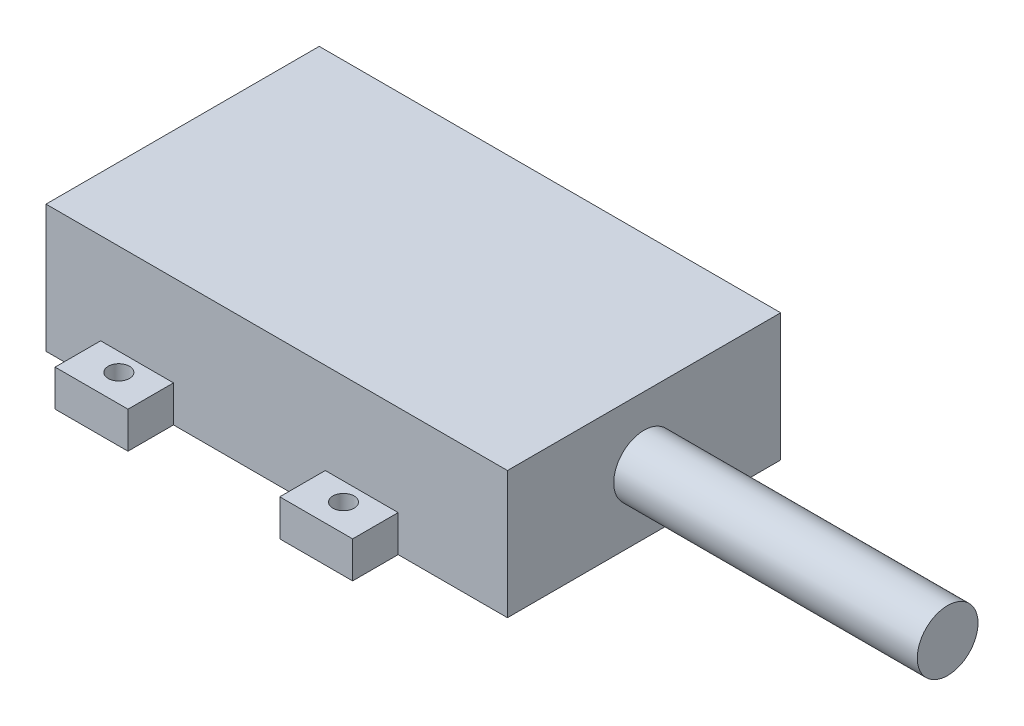
ISO-10303-21;
HEADER;
FILE_DESCRIPTION(('STEP AP214'),'2;1');
FILE_NAME('part.step','',(''),(''),'','','');
FILE_SCHEMA(('AUTOMOTIVE_DESIGN { 1 0 10303 214 1 1 1 1 }'));
ENDSEC;
DATA;
#1=APPLICATION_CONTEXT('core data for automotive mechanical design processes');
#2=APPLICATION_PROTOCOL_DEFINITION('international standard','automotive_design',2000,#1);
#3=PRODUCT_CONTEXT('',#1,'mechanical');
#4=PRODUCT('Part','Part','',(#3));
#5=PRODUCT_RELATED_PRODUCT_CATEGORY('part','',(#4));
#6=PRODUCT_DEFINITION_FORMATION('','',#4);
#7=PRODUCT_DEFINITION_CONTEXT('part definition',#1,'design');
#8=PRODUCT_DEFINITION('design','',#6,#7);
#9=PRODUCT_DEFINITION_SHAPE('','',#8);
#10=(LENGTH_UNIT() NAMED_UNIT(*) SI_UNIT(.MILLI.,.METRE.));
#11=(NAMED_UNIT(*) PLANE_ANGLE_UNIT() SI_UNIT($,.RADIAN.));
#12=(NAMED_UNIT(*) SI_UNIT($,.STERADIAN.) SOLID_ANGLE_UNIT());
#13=UNCERTAINTY_MEASURE_WITH_UNIT(LENGTH_MEASURE(1.E-05),#10,'distance_accuracy_value','');
#14=(GEOMETRIC_REPRESENTATION_CONTEXT(3) GLOBAL_UNCERTAINTY_ASSIGNED_CONTEXT((#13)) GLOBAL_UNIT_ASSIGNED_CONTEXT((#10,
#11,#12)) REPRESENTATION_CONTEXT('',''));
#15=CARTESIAN_POINT('',(0.,0.,0.));
#16=DIRECTION('',(0.,0.,1.));
#17=DIRECTION('',(1.,0.,0.));
#18=AXIS2_PLACEMENT_3D('',#15,#16,#17);
#19=CARTESIAN_POINT('',(-38.,21.,-22.5));
#20=DIRECTION('',(0.,0.,1.));
#21=DIRECTION('',(1.,0.,0.));
#22=AXIS2_PLACEMENT_3D('',#19,#20,#21);
#23=PLANE('',#22);
#24=DIRECTION('',(0.,1.,0.));
#25=VECTOR('',#24,1.);
#26=CARTESIAN_POINT('',(-29.,21.,-22.5));
#27=LINE('',#26,#25);
#28=CARTESIAN_POINT('',(-29.,0.,-22.5));
#29=VERTEX_POINT('',#28);
#30=CARTESIAN_POINT('',(-29.,6.,-22.5));
#31=VERTEX_POINT('',#30);
#32=EDGE_CURVE('E216',#29,#31,#27,.T.);
#33=ORIENTED_EDGE('',*,*,#32,.F.);
#34=DIRECTION('',(-1.,0.,0.));
#35=VECTOR('',#34,1.);
#36=CARTESIAN_POINT('',(-38.,0.,-22.5));
#37=LINE('',#36,#35);
#38=CARTESIAN_POINT('',(-38.,0.,-22.5));
#39=VERTEX_POINT('',#38);
#40=EDGE_CURVE('E370',#29,#39,#37,.T.);
#41=ORIENTED_EDGE('',*,*,#40,.T.);
#42=DIRECTION('',(0.,-1.,0.));
#43=VECTOR('',#42,1.);
#44=CARTESIAN_POINT('',(-38.,21.,-22.5));
#45=LINE('',#44,#43);
#46=CARTESIAN_POINT('',(-38.,21.,-22.5));
#47=VERTEX_POINT('',#46);
#48=EDGE_CURVE('E389',#47,#39,#45,.T.);
#49=ORIENTED_EDGE('',*,*,#48,.F.);
#50=DIRECTION('',(-1.,0.,0.));
#51=VECTOR('',#50,1.);
#52=CARTESIAN_POINT('',(-38.,21.,-22.5));
#53=LINE('',#52,#51);
#54=CARTESIAN_POINT('',(38.,21.,-22.5));
#55=VERTEX_POINT('',#54);
#56=EDGE_CURVE('E356',#55,#47,#53,.T.);
#57=ORIENTED_EDGE('',*,*,#56,.F.);
#58=DIRECTION('',(0.,-1.,0.));
#59=VECTOR('',#58,1.);
#60=CARTESIAN_POINT('',(38.,21.,-22.5));
#61=LINE('',#60,#59);
#62=CARTESIAN_POINT('',(38.,0.,-22.5));
#63=VERTEX_POINT('',#62);
#64=EDGE_CURVE('E393',#55,#63,#61,.T.);
#65=ORIENTED_EDGE('',*,*,#64,.T.);
#66=CARTESIAN_POINT('',(20.,0.,-22.5));
#67=VERTEX_POINT('',#66);
#68=EDGE_CURVE('E371',#63,#67,#37,.T.);
#69=ORIENTED_EDGE('',*,*,#68,.T.);
#70=DIRECTION('',(0.,-1.,0.));
#71=VECTOR('',#70,1.);
#72=CARTESIAN_POINT('',(20.,21.,-22.5));
#73=LINE('',#72,#71);
#74=CARTESIAN_POINT('',(20.,6.,-22.5));
#75=VERTEX_POINT('',#74);
#76=EDGE_CURVE('E255',#75,#67,#73,.T.);
#77=ORIENTED_EDGE('',*,*,#76,.F.);
#78=DIRECTION('',(1.,0.,0.));
#79=VECTOR('',#78,1.);
#80=CARTESIAN_POINT('',(-38.,6.,-22.5));
#81=LINE('',#80,#79);
#82=CARTESIAN_POINT('',(8.,6.,-22.5));
#83=VERTEX_POINT('',#82);
#84=EDGE_CURVE('E402',#83,#75,#81,.T.);
#85=ORIENTED_EDGE('',*,*,#84,.F.);
#86=DIRECTION('',(0.,1.,0.));
#87=VECTOR('',#86,1.);
#88=CARTESIAN_POINT('',(8.00000000000001,21.,-22.5));
#89=LINE('',#88,#87);
#90=CARTESIAN_POINT('',(8.,0.,-22.5));
#91=VERTEX_POINT('',#90);
#92=EDGE_CURVE('E259',#91,#83,#89,.T.);
#93=ORIENTED_EDGE('',*,*,#92,.F.);
#94=CARTESIAN_POINT('',(-17.,0.,-22.5));
#95=VERTEX_POINT('',#94);
#96=EDGE_CURVE('E375',#91,#95,#37,.T.);
#97=ORIENTED_EDGE('',*,*,#96,.T.);
#98=DIRECTION('',(0.,-1.,0.));
#99=VECTOR('',#98,1.);
#100=CARTESIAN_POINT('',(-17.,21.,-22.5));
#101=LINE('',#100,#99);
#102=CARTESIAN_POINT('',(-17.,6.,-22.5));
#103=VERTEX_POINT('',#102);
#104=EDGE_CURVE('E60',#103,#95,#101,.T.);
#105=ORIENTED_EDGE('',*,*,#104,.F.);
#106=DIRECTION('',(1.,0.,0.));
#107=VECTOR('',#106,1.);
#108=CARTESIAN_POINT('',(-38.,6.,-22.5));
#109=LINE('',#108,#107);
#110=EDGE_CURVE('E43',#31,#103,#109,.T.);
#111=ORIENTED_EDGE('',*,*,#110,.F.);
#112=EDGE_LOOP('',(#33,#41,#49,#57,#65,#69,#77,#85,#93,#97,#105,#111));
#113=FACE_BOUND('',#112,.T.);
#114=ADVANCED_FACE('F39',(#113),#23,.F.);
#115=CARTESIAN_POINT('',(-38.,21.,22.5));
#116=DIRECTION('',(0.,0.,-1.));
#117=DIRECTION('',(-1.,0.,0.));
#118=AXIS2_PLACEMENT_3D('',#115,#116,#117);
#119=PLANE('',#118);
#120=DIRECTION('',(0.,1.,0.));
#121=VECTOR('',#120,1.);
#122=CARTESIAN_POINT('',(20.,21.,22.5));
#123=LINE('',#122,#121);
#124=CARTESIAN_POINT('',(20.,0.,22.5));
#125=VERTEX_POINT('',#124);
#126=CARTESIAN_POINT('',(20.,6.,22.5));
#127=VERTEX_POINT('',#126);
#128=EDGE_CURVE('E303',#125,#127,#123,.T.);
#129=ORIENTED_EDGE('',*,*,#128,.F.);
#130=DIRECTION('',(1.,0.,0.));
#131=VECTOR('',#130,1.);
#132=CARTESIAN_POINT('',(-38.,0.,22.5));
#133=LINE('',#132,#131);
#134=CARTESIAN_POINT('',(38.,0.,22.5));
#135=VERTEX_POINT('',#134);
#136=EDGE_CURVE('E378',#125,#135,#133,.T.);
#137=ORIENTED_EDGE('',*,*,#136,.T.);
#138=DIRECTION('',(0.,-1.,0.));
#139=VECTOR('',#138,1.);
#140=CARTESIAN_POINT('',(38.,21.,22.5));
#141=LINE('',#140,#139);
#142=CARTESIAN_POINT('',(38.,21.,22.5));
#143=VERTEX_POINT('',#142);
#144=EDGE_CURVE('E366',#143,#135,#141,.T.);
#145=ORIENTED_EDGE('',*,*,#144,.F.);
#146=DIRECTION('',(1.,0.,0.));
#147=VECTOR('',#146,1.);
#148=CARTESIAN_POINT('',(-38.,21.,22.5));
#149=LINE('',#148,#147);
#150=CARTESIAN_POINT('',(-38.,21.,22.5));
#151=VERTEX_POINT('',#150);
#152=EDGE_CURVE('E363',#151,#143,#149,.T.);
#153=ORIENTED_EDGE('',*,*,#152,.F.);
#154=DIRECTION('',(0.,-1.,0.));
#155=VECTOR('',#154,1.);
#156=CARTESIAN_POINT('',(-38.,21.,22.5));
#157=LINE('',#156,#155);
#158=CARTESIAN_POINT('',(-38.,0.,22.5));
#159=VERTEX_POINT('',#158);
#160=EDGE_CURVE('E385',#151,#159,#157,.T.);
#161=ORIENTED_EDGE('',*,*,#160,.T.);
#162=CARTESIAN_POINT('',(-29.,0.,22.5));
#163=VERTEX_POINT('',#162);
#164=EDGE_CURVE('E357',#159,#163,#133,.T.);
#165=ORIENTED_EDGE('',*,*,#164,.T.);
#166=DIRECTION('',(0.,-1.,0.));
#167=VECTOR('',#166,1.);
#168=CARTESIAN_POINT('',(-29.,21.,22.5));
#169=LINE('',#168,#167);
#170=CARTESIAN_POINT('',(-29.,6.,22.5));
#171=VERTEX_POINT('',#170);
#172=EDGE_CURVE('E343',#171,#163,#169,.T.);
#173=ORIENTED_EDGE('',*,*,#172,.F.);
#174=DIRECTION('',(1.,0.,0.));
#175=VECTOR('',#174,1.);
#176=CARTESIAN_POINT('',(-38.,6.,22.5));
#177=LINE('',#176,#175);
#178=CARTESIAN_POINT('',(-17.,6.,22.5));
#179=VERTEX_POINT('',#178);
#180=EDGE_CURVE('E397',#171,#179,#177,.T.);
#181=ORIENTED_EDGE('',*,*,#180,.T.);
#182=DIRECTION('',(0.,1.,0.));
#183=VECTOR('',#182,1.);
#184=CARTESIAN_POINT('',(-17.,21.,22.5));
#185=LINE('',#184,#183);
#186=CARTESIAN_POINT('',(-17.,0.,22.5));
#187=VERTEX_POINT('',#186);
#188=EDGE_CURVE('E347',#187,#179,#185,.T.);
#189=ORIENTED_EDGE('',*,*,#188,.F.);
#190=CARTESIAN_POINT('',(8.,0.,22.5));
#191=VERTEX_POINT('',#190);
#192=EDGE_CURVE('E381',#187,#191,#133,.T.);
#193=ORIENTED_EDGE('',*,*,#192,.T.);
#194=DIRECTION('',(0.,-1.,0.));
#195=VECTOR('',#194,1.);
#196=CARTESIAN_POINT('',(8.,21.,22.5));
#197=LINE('',#196,#195);
#198=CARTESIAN_POINT('',(8.,6.,22.5));
#199=VERTEX_POINT('',#198);
#200=EDGE_CURVE('E299',#199,#191,#197,.T.);
#201=ORIENTED_EDGE('',*,*,#200,.F.);
#202=DIRECTION('',(1.,0.,0.));
#203=VECTOR('',#202,1.);
#204=CARTESIAN_POINT('',(-38.,6.,22.5));
#205=LINE('',#204,#203);
#206=EDGE_CURVE('E400',#199,#127,#205,.T.);
#207=ORIENTED_EDGE('',*,*,#206,.T.);
#208=EDGE_LOOP('',(#129,#137,#145,#153,#161,#165,#173,#181,#189,#193,#201,#207));
#209=FACE_BOUND('',#208,.T.);
#210=ADVANCED_FACE('F440',(#209),#119,.F.);
#211=CARTESIAN_POINT('',(38.,21.,-22.5));
#212=DIRECTION('',(-1.,0.,0.));
#213=DIRECTION('',(0.,0.,1.));
#214=AXIS2_PLACEMENT_3D('',#211,#212,#213);
#215=PLANE('',#214);
#216=CARTESIAN_POINT('',(38.,10.5,0.));
#217=DIRECTION('',(1.,0.,0.));
#218=DIRECTION('',(0.,0.,-1.));
#219=AXIS2_PLACEMENT_3D('',#216,#217,#218);
#220=CIRCLE('',#219,5.);
#221=CARTESIAN_POINT('',(38.,10.5,-5.));
#222=VERTEX_POINT('',#221);
#223=EDGE_CURVE('E11',#222,#222,#220,.T.);
#224=ORIENTED_EDGE('',*,*,#223,.F.);
#225=EDGE_LOOP('',(#224));
#226=FACE_BOUND('',#225,.T.);
#227=DIRECTION('',(0.,0.,-1.));
#228=VECTOR('',#227,1.);
#229=CARTESIAN_POINT('',(38.,0.,-22.5));
#230=LINE('',#229,#228);
#231=EDGE_CURVE('E351',#135,#63,#230,.T.);
#232=ORIENTED_EDGE('',*,*,#231,.T.);
#233=ORIENTED_EDGE('',*,*,#64,.F.);
#234=DIRECTION('',(0.,0.,-1.));
#235=VECTOR('',#234,1.);
#236=CARTESIAN_POINT('',(38.,21.,-22.5));
#237=LINE('',#236,#235);
#238=EDGE_CURVE('E352',#143,#55,#237,.T.);
#239=ORIENTED_EDGE('',*,*,#238,.F.);
#240=ORIENTED_EDGE('',*,*,#144,.T.);
#241=EDGE_LOOP('',(#232,#233,#239,#240));
#242=FACE_BOUND('',#241,.T.);
#243=ADVANCED_FACE('F41',(#226,#242),#215,.F.);
#244=CARTESIAN_POINT('',(-38.,21.,-22.5));
#245=DIRECTION('',(1.,0.,0.));
#246=DIRECTION('',(0.,0.,-1.));
#247=AXIS2_PLACEMENT_3D('',#244,#245,#246);
#248=PLANE('',#247);
#249=DIRECTION('',(0.,0.,1.));
#250=VECTOR('',#249,1.);
#251=CARTESIAN_POINT('',(-38.,0.,-22.5));
#252=LINE('',#251,#250);
#253=EDGE_CURVE('E374',#39,#159,#252,.T.);
#254=ORIENTED_EDGE('',*,*,#253,.T.);
#255=ORIENTED_EDGE('',*,*,#160,.F.);
#256=DIRECTION('',(0.,0.,1.));
#257=VECTOR('',#256,1.);
#258=CARTESIAN_POINT('',(-38.,21.,-22.5));
#259=LINE('',#258,#257);
#260=EDGE_CURVE('E360',#47,#151,#259,.T.);
#261=ORIENTED_EDGE('',*,*,#260,.F.);
#262=ORIENTED_EDGE('',*,*,#48,.T.);
#263=EDGE_LOOP('',(#254,#255,#261,#262));
#264=FACE_BOUND('',#263,.T.);
#265=ADVANCED_FACE('F434',(#264),#248,.F.);
#266=CARTESIAN_POINT('',(0.,21.,0.));
#267=DIRECTION('',(0.,1.,0.));
#268=DIRECTION('',(0.,0.,1.));
#269=AXIS2_PLACEMENT_3D('',#266,#267,#268);
#270=PLANE('',#269);
#271=ORIENTED_EDGE('',*,*,#238,.T.);
#272=ORIENTED_EDGE('',*,*,#56,.T.);
#273=ORIENTED_EDGE('',*,*,#260,.T.);
#274=ORIENTED_EDGE('',*,*,#152,.T.);
#275=EDGE_LOOP('',(#271,#272,#273,#274));
#276=FACE_BOUND('',#275,.T.);
#277=ADVANCED_FACE('F468',(#276),#270,.T.);
#278=CARTESIAN_POINT('',(0.,0.,0.));
#279=DIRECTION('',(0.,1.,0.));
#280=DIRECTION('',(0.,0.,1.));
#281=AXIS2_PLACEMENT_3D('',#278,#279,#280);
#282=PLANE('',#281);
#283=ORIENTED_EDGE('',*,*,#40,.F.);
#284=DIRECTION('',(0.,0.,1.));
#285=VECTOR('',#284,1.);
#286=CARTESIAN_POINT('',(-29.,0.,-15.));
#287=LINE('',#286,#285);
#288=CARTESIAN_POINT('',(-29.,0.,-30.));
#289=VERTEX_POINT('',#288);
#290=EDGE_CURVE('E204',#289,#29,#287,.T.);
#291=ORIENTED_EDGE('',*,*,#290,.F.);
#292=DIRECTION('',(-1.,0.,0.));
#293=VECTOR('',#292,1.);
#294=CARTESIAN_POINT('',(-29.,0.,-30.));
#295=LINE('',#294,#293);
#296=CARTESIAN_POINT('',(-17.,0.,-30.));
#297=VERTEX_POINT('',#296);
#298=EDGE_CURVE('E211',#297,#289,#295,.T.);
#299=ORIENTED_EDGE('',*,*,#298,.F.);
#300=DIRECTION('',(0.,0.,-1.));
#301=VECTOR('',#300,1.);
#302=CARTESIAN_POINT('',(-17.,0.,-15.));
#303=LINE('',#302,#301);
#304=EDGE_CURVE('E189',#95,#297,#303,.T.);
#305=ORIENTED_EDGE('',*,*,#304,.F.);
#306=ORIENTED_EDGE('',*,*,#96,.F.);
#307=DIRECTION('',(0.,0.,1.));
#308=VECTOR('',#307,1.);
#309=CARTESIAN_POINT('',(8.,0.,-15.));
#310=LINE('',#309,#308);
#311=CARTESIAN_POINT('',(8.00000000000001,0.,-30.));
#312=VERTEX_POINT('',#311);
#313=EDGE_CURVE('E224',#312,#91,#310,.T.);
#314=ORIENTED_EDGE('',*,*,#313,.F.);
#315=DIRECTION('',(-1.,0.,0.));
#316=VECTOR('',#315,1.);
#317=CARTESIAN_POINT('',(8.00000000000001,0.,-30.));
#318=LINE('',#317,#316);
#319=CARTESIAN_POINT('',(20.,0.,-30.));
#320=VERTEX_POINT('',#319);
#321=EDGE_CURVE('E233',#320,#312,#318,.T.);
#322=ORIENTED_EDGE('',*,*,#321,.F.);
#323=DIRECTION('',(0.,0.,-1.));
#324=VECTOR('',#323,1.);
#325=CARTESIAN_POINT('',(20.,0.,-15.));
#326=LINE('',#325,#324);
#327=EDGE_CURVE('E243',#67,#320,#326,.T.);
#328=ORIENTED_EDGE('',*,*,#327,.F.);
#329=ORIENTED_EDGE('',*,*,#68,.F.);
#330=ORIENTED_EDGE('',*,*,#231,.F.);
#331=ORIENTED_EDGE('',*,*,#136,.F.);
#332=DIRECTION('',(0.,0.,-1.));
#333=VECTOR('',#332,1.);
#334=CARTESIAN_POINT('',(20.,0.,15.));
#335=LINE('',#334,#333);
#336=CARTESIAN_POINT('',(20.,0.,30.));
#337=VERTEX_POINT('',#336);
#338=EDGE_CURVE('E268',#337,#125,#335,.T.);
#339=ORIENTED_EDGE('',*,*,#338,.F.);
#340=DIRECTION('',(1.,0.,0.));
#341=VECTOR('',#340,1.);
#342=CARTESIAN_POINT('',(8.,0.,30.));
#343=LINE('',#342,#341);
#344=CARTESIAN_POINT('',(8.,0.,30.));
#345=VERTEX_POINT('',#344);
#346=EDGE_CURVE('E277',#345,#337,#343,.T.);
#347=ORIENTED_EDGE('',*,*,#346,.F.);
#348=DIRECTION('',(0.,0.,1.));
#349=VECTOR('',#348,1.);
#350=CARTESIAN_POINT('',(8.,0.,15.));
#351=LINE('',#350,#349);
#352=EDGE_CURVE('E287',#191,#345,#351,.T.);
#353=ORIENTED_EDGE('',*,*,#352,.F.);
#354=ORIENTED_EDGE('',*,*,#192,.F.);
#355=DIRECTION('',(0.,0.,-1.));
#356=VECTOR('',#355,1.);
#357=CARTESIAN_POINT('',(-17.,0.,15.));
#358=LINE('',#357,#356);
#359=CARTESIAN_POINT('',(-17.,0.,30.));
#360=VERTEX_POINT('',#359);
#361=EDGE_CURVE('E312',#360,#187,#358,.T.);
#362=ORIENTED_EDGE('',*,*,#361,.F.);
#363=DIRECTION('',(1.,0.,0.));
#364=VECTOR('',#363,1.);
#365=CARTESIAN_POINT('',(-29.,0.,30.));
#366=LINE('',#365,#364);
#367=CARTESIAN_POINT('',(-29.,0.,30.));
#368=VERTEX_POINT('',#367);
#369=EDGE_CURVE('E321',#368,#360,#366,.T.);
#370=ORIENTED_EDGE('',*,*,#369,.F.);
#371=DIRECTION('',(0.,0.,1.));
#372=VECTOR('',#371,1.);
#373=CARTESIAN_POINT('',(-29.,0.,15.));
#374=LINE('',#373,#372);
#375=EDGE_CURVE('E331',#163,#368,#374,.T.);
#376=ORIENTED_EDGE('',*,*,#375,.F.);
#377=ORIENTED_EDGE('',*,*,#164,.F.);
#378=ORIENTED_EDGE('',*,*,#253,.F.);
#379=EDGE_LOOP('',(#283,#291,#299,#305,#306,#314,#322,#328,#329,#330,#331,#339,#347,#353,#354,
#362,#370,#376,#377,#378));
#380=FACE_BOUND('',#379,.T.);
#381=CARTESIAN_POINT('',(14.,0.,-25.5));
#382=DIRECTION('',(0.,1.,0.));
#383=DIRECTION('',(0.,0.,-1.));
#384=AXIS2_PLACEMENT_3D('',#381,#382,#383);
#385=CIRCLE('',#384,1.75);
#386=CARTESIAN_POINT('',(14.,0.,-27.25));
#387=VERTEX_POINT('',#386);
#388=EDGE_CURVE('E219',#387,#387,#385,.T.);
#389=ORIENTED_EDGE('',*,*,#388,.T.);
#390=EDGE_LOOP('',(#389));
#391=FACE_BOUND('',#390,.T.);
#392=CARTESIAN_POINT('',(-23.,0.,25.5));
#393=DIRECTION('',(0.,1.,0.));
#394=DIRECTION('',(0.,0.,1.));
#395=AXIS2_PLACEMENT_3D('',#392,#393,#394);
#396=CIRCLE('',#395,1.75);
#397=CARTESIAN_POINT('',(-23.,0.,27.25));
#398=VERTEX_POINT('',#397);
#399=EDGE_CURVE('E307',#398,#398,#396,.T.);
#400=ORIENTED_EDGE('',*,*,#399,.T.);
#401=EDGE_LOOP('',(#400));
#402=FACE_BOUND('',#401,.T.);
#403=CARTESIAN_POINT('',(14.,0.,25.5));
#404=DIRECTION('',(0.,1.,0.));
#405=DIRECTION('',(0.,0.,1.));
#406=AXIS2_PLACEMENT_3D('',#403,#404,#405);
#407=CIRCLE('',#406,1.75);
#408=CARTESIAN_POINT('',(14.,0.,27.25));
#409=VERTEX_POINT('',#408);
#410=EDGE_CURVE('E263',#409,#409,#407,.T.);
#411=ORIENTED_EDGE('',*,*,#410,.T.);
#412=EDGE_LOOP('',(#411));
#413=FACE_BOUND('',#412,.T.);
#414=CARTESIAN_POINT('',(-23.,0.,-25.5));
#415=DIRECTION('',(0.,1.,0.));
#416=DIRECTION('',(0.,0.,-1.));
#417=AXIS2_PLACEMENT_3D('',#414,#415,#416);
#418=CIRCLE('',#417,1.75);
#419=CARTESIAN_POINT('',(-23.,0.,-27.25));
#420=VERTEX_POINT('',#419);
#421=EDGE_CURVE('E743',#420,#420,#418,.T.);
#422=ORIENTED_EDGE('',*,*,#421,.T.);
#423=EDGE_LOOP('',(#422));
#424=FACE_BOUND('',#423,.T.);
#425=ADVANCED_FACE('F425',(#380,#391,#402,#413,#424),#282,.F.);
#426=CARTESIAN_POINT('',(0.,6.,0.));
#427=DIRECTION('',(0.,1.,0.));
#428=DIRECTION('',(0.,0.,1.));
#429=AXIS2_PLACEMENT_3D('',#426,#427,#428);
#430=PLANE('',#429);
#431=CARTESIAN_POINT('',(-23.,6.,25.5));
#432=DIRECTION('',(0.,1.,0.));
#433=DIRECTION('',(0.,0.,1.));
#434=AXIS2_PLACEMENT_3D('',#431,#432,#433);
#435=CIRCLE('',#434,1.75);
#436=CARTESIAN_POINT('',(-23.,6.,27.25));
#437=VERTEX_POINT('',#436);
#438=EDGE_CURVE('E308',#437,#437,#435,.T.);
#439=ORIENTED_EDGE('',*,*,#438,.F.);
#440=EDGE_LOOP('',(#439));
#441=FACE_BOUND('',#440,.T.);
#442=ORIENTED_EDGE('',*,*,#180,.F.);
#443=DIRECTION('',(0.,0.,1.));
#444=VECTOR('',#443,1.);
#445=CARTESIAN_POINT('',(-29.,6.,15.));
#446=LINE('',#445,#444);
#447=CARTESIAN_POINT('',(-29.,6.,30.));
#448=VERTEX_POINT('',#447);
#449=EDGE_CURVE('E320',#171,#448,#446,.T.);
#450=ORIENTED_EDGE('',*,*,#449,.T.);
#451=DIRECTION('',(1.,0.,0.));
#452=VECTOR('',#451,1.);
#453=CARTESIAN_POINT('',(-29.,6.,30.));
#454=LINE('',#453,#452);
#455=CARTESIAN_POINT('',(-17.,6.,30.));
#456=VERTEX_POINT('',#455);
#457=EDGE_CURVE('E324',#448,#456,#454,.T.);
#458=ORIENTED_EDGE('',*,*,#457,.T.);
#459=DIRECTION('',(0.,0.,-1.));
#460=VECTOR('',#459,1.);
#461=CARTESIAN_POINT('',(-17.,6.,15.));
#462=LINE('',#461,#460);
#463=EDGE_CURVE('E316',#456,#179,#462,.T.);
#464=ORIENTED_EDGE('',*,*,#463,.T.);
#465=EDGE_LOOP('',(#442,#450,#458,#464));
#466=FACE_BOUND('',#465,.T.);
#467=ADVANCED_FACE('F449',(#441,#466),#430,.T.);
#468=CARTESIAN_POINT('',(-17.,6.,15.));
#469=DIRECTION('',(-1.,0.,0.));
#470=DIRECTION('',(0.,0.,1.));
#471=AXIS2_PLACEMENT_3D('',#468,#469,#470);
#472=PLANE('',#471);
#473=ORIENTED_EDGE('',*,*,#361,.T.);
#474=ORIENTED_EDGE('',*,*,#188,.T.);
#475=ORIENTED_EDGE('',*,*,#463,.F.);
#476=DIRECTION('',(0.,-1.,0.));
#477=VECTOR('',#476,1.);
#478=CARTESIAN_POINT('',(-17.,6.,30.));
#479=LINE('',#478,#477);
#480=EDGE_CURVE('E327',#456,#360,#479,.T.);
#481=ORIENTED_EDGE('',*,*,#480,.T.);
#482=EDGE_LOOP('',(#473,#474,#475,#481));
#483=FACE_BOUND('',#482,.T.);
#484=ADVANCED_FACE('F454',(#483),#472,.F.);
#485=CARTESIAN_POINT('',(-29.,6.,15.));
#486=DIRECTION('',(1.,0.,0.));
#487=DIRECTION('',(0.,0.,-1.));
#488=AXIS2_PLACEMENT_3D('',#485,#486,#487);
#489=PLANE('',#488);
#490=ORIENTED_EDGE('',*,*,#449,.F.);
#491=ORIENTED_EDGE('',*,*,#172,.T.);
#492=ORIENTED_EDGE('',*,*,#375,.T.);
#493=DIRECTION('',(0.,-1.,0.));
#494=VECTOR('',#493,1.);
#495=CARTESIAN_POINT('',(-29.,6.,30.));
#496=LINE('',#495,#494);
#497=EDGE_CURVE('E339',#448,#368,#496,.T.);
#498=ORIENTED_EDGE('',*,*,#497,.F.);
#499=EDGE_LOOP('',(#490,#491,#492,#498));
#500=FACE_BOUND('',#499,.T.);
#501=ADVANCED_FACE('F445',(#500),#489,.F.);
#502=CARTESIAN_POINT('',(-29.,6.,30.));
#503=DIRECTION('',(0.,0.,-1.));
#504=DIRECTION('',(-1.,0.,0.));
#505=AXIS2_PLACEMENT_3D('',#502,#503,#504);
#506=PLANE('',#505);
#507=ORIENTED_EDGE('',*,*,#369,.T.);
#508=ORIENTED_EDGE('',*,*,#480,.F.);
#509=ORIENTED_EDGE('',*,*,#457,.F.);
#510=ORIENTED_EDGE('',*,*,#497,.T.);
#511=EDGE_LOOP('',(#507,#508,#509,#510));
#512=FACE_BOUND('',#511,.T.);
#513=ADVANCED_FACE('F554',(#512),#506,.F.);
#514=CARTESIAN_POINT('',(-23.,6.,25.5));
#515=DIRECTION('',(0.,-1.,0.));
#516=DIRECTION('',(0.,0.,-1.));
#517=AXIS2_PLACEMENT_3D('',#514,#515,#516);
#518=CYLINDRICAL_SURFACE('',#517,1.75);
#519=ORIENTED_EDGE('',*,*,#438,.T.);
#520=EDGE_LOOP('',(#519));
#521=FACE_BOUND('',#520,.T.);
#522=ORIENTED_EDGE('',*,*,#399,.F.);
#523=EDGE_LOOP('',(#522));
#524=FACE_BOUND('',#523,.T.);
#525=ADVANCED_FACE('F540',(#521,#524),#518,.F.);
#526=CARTESIAN_POINT('',(0.,6.,0.));
#527=DIRECTION('',(0.,1.,0.));
#528=DIRECTION('',(0.,0.,1.));
#529=AXIS2_PLACEMENT_3D('',#526,#527,#528);
#530=PLANE('',#529);
#531=CARTESIAN_POINT('',(14.,6.,25.5));
#532=DIRECTION('',(0.,1.,0.));
#533=DIRECTION('',(0.,0.,1.));
#534=AXIS2_PLACEMENT_3D('',#531,#532,#533);
#535=CIRCLE('',#534,1.75);
#536=CARTESIAN_POINT('',(14.,6.,27.25));
#537=VERTEX_POINT('',#536);
#538=EDGE_CURVE('E264',#537,#537,#535,.T.);
#539=ORIENTED_EDGE('',*,*,#538,.F.);
#540=EDGE_LOOP('',(#539));
#541=FACE_BOUND('',#540,.T.);
#542=ORIENTED_EDGE('',*,*,#206,.F.);
#543=DIRECTION('',(0.,0.,1.));
#544=VECTOR('',#543,1.);
#545=CARTESIAN_POINT('',(8.,6.,15.));
#546=LINE('',#545,#544);
#547=CARTESIAN_POINT('',(8.,6.,30.));
#548=VERTEX_POINT('',#547);
#549=EDGE_CURVE('E276',#199,#548,#546,.T.);
#550=ORIENTED_EDGE('',*,*,#549,.T.);
#551=DIRECTION('',(1.,0.,0.));
#552=VECTOR('',#551,1.);
#553=CARTESIAN_POINT('',(8.,6.,30.));
#554=LINE('',#553,#552);
#555=CARTESIAN_POINT('',(20.,6.,30.));
#556=VERTEX_POINT('',#555);
#557=EDGE_CURVE('E280',#548,#556,#554,.T.);
#558=ORIENTED_EDGE('',*,*,#557,.T.);
#559=DIRECTION('',(0.,0.,-1.));
#560=VECTOR('',#559,1.);
#561=CARTESIAN_POINT('',(20.,6.,15.));
#562=LINE('',#561,#560);
#563=EDGE_CURVE('E272',#556,#127,#562,.T.);
#564=ORIENTED_EDGE('',*,*,#563,.T.);
#565=EDGE_LOOP('',(#542,#550,#558,#564));
#566=FACE_BOUND('',#565,.T.);
#567=ADVANCED_FACE('F536',(#541,#566),#530,.T.);
#568=CARTESIAN_POINT('',(20.,6.,15.));
#569=DIRECTION('',(-1.,0.,0.));
#570=DIRECTION('',(0.,0.,1.));
#571=AXIS2_PLACEMENT_3D('',#568,#569,#570);
#572=PLANE('',#571);
#573=ORIENTED_EDGE('',*,*,#338,.T.);
#574=ORIENTED_EDGE('',*,*,#128,.T.);
#575=ORIENTED_EDGE('',*,*,#563,.F.);
#576=DIRECTION('',(0.,-1.,0.));
#577=VECTOR('',#576,1.);
#578=CARTESIAN_POINT('',(20.,6.,30.));
#579=LINE('',#578,#577);
#580=EDGE_CURVE('E283',#556,#337,#579,.T.);
#581=ORIENTED_EDGE('',*,*,#580,.T.);
#582=EDGE_LOOP('',(#573,#574,#575,#581));
#583=FACE_BOUND('',#582,.T.);
#584=ADVANCED_FACE('F539',(#583),#572,.F.);
#585=CARTESIAN_POINT('',(8.,6.,15.));
#586=DIRECTION('',(1.,0.,0.));
#587=DIRECTION('',(0.,0.,-1.));
#588=AXIS2_PLACEMENT_3D('',#585,#586,#587);
#589=PLANE('',#588);
#590=ORIENTED_EDGE('',*,*,#549,.F.);
#591=ORIENTED_EDGE('',*,*,#200,.T.);
#592=ORIENTED_EDGE('',*,*,#352,.T.);
#593=DIRECTION('',(0.,-1.,0.));
#594=VECTOR('',#593,1.);
#595=CARTESIAN_POINT('',(8.,6.,30.));
#596=LINE('',#595,#594);
#597=EDGE_CURVE('E295',#548,#345,#596,.T.);
#598=ORIENTED_EDGE('',*,*,#597,.F.);
#599=EDGE_LOOP('',(#590,#591,#592,#598));
#600=FACE_BOUND('',#599,.T.);
#601=ADVANCED_FACE('F544',(#600),#589,.F.);
#602=CARTESIAN_POINT('',(8.,6.,30.));
#603=DIRECTION('',(0.,0.,-1.));
#604=DIRECTION('',(-1.,0.,0.));
#605=AXIS2_PLACEMENT_3D('',#602,#603,#604);
#606=PLANE('',#605);
#607=ORIENTED_EDGE('',*,*,#346,.T.);
#608=ORIENTED_EDGE('',*,*,#580,.F.);
#609=ORIENTED_EDGE('',*,*,#557,.F.);
#610=ORIENTED_EDGE('',*,*,#597,.T.);
#611=EDGE_LOOP('',(#607,#608,#609,#610));
#612=FACE_BOUND('',#611,.T.);
#613=ADVANCED_FACE('F534',(#612),#606,.F.);
#614=CARTESIAN_POINT('',(14.,6.,25.5));
#615=DIRECTION('',(0.,-1.,0.));
#616=DIRECTION('',(0.,0.,-1.));
#617=AXIS2_PLACEMENT_3D('',#614,#615,#616);
#618=CYLINDRICAL_SURFACE('',#617,1.75);
#619=ORIENTED_EDGE('',*,*,#538,.T.);
#620=EDGE_LOOP('',(#619));
#621=FACE_BOUND('',#620,.T.);
#622=ORIENTED_EDGE('',*,*,#410,.F.);
#623=EDGE_LOOP('',(#622));
#624=FACE_BOUND('',#623,.T.);
#625=ADVANCED_FACE('F524',(#621,#624),#618,.F.);
#626=CARTESIAN_POINT('',(0.,6.,0.));
#627=DIRECTION('',(0.,-1.,0.));
#628=DIRECTION('',(0.,0.,-1.));
#629=AXIS2_PLACEMENT_3D('',#626,#627,#628);
#630=PLANE('',#629);
#631=CARTESIAN_POINT('',(14.,6.,-25.5));
#632=DIRECTION('',(0.,1.,0.));
#633=DIRECTION('',(0.,0.,-1.));
#634=AXIS2_PLACEMENT_3D('',#631,#632,#633);
#635=CIRCLE('',#634,1.75);
#636=CARTESIAN_POINT('',(14.,6.,-27.25));
#637=VERTEX_POINT('',#636);
#638=EDGE_CURVE('E220',#637,#637,#635,.T.);
#639=ORIENTED_EDGE('',*,*,#638,.F.);
#640=EDGE_LOOP('',(#639));
#641=FACE_BOUND('',#640,.T.);
#642=DIRECTION('',(0.,0.,1.));
#643=VECTOR('',#642,1.);
#644=CARTESIAN_POINT('',(8.,6.,-15.));
#645=LINE('',#644,#643);
#646=CARTESIAN_POINT('',(8.00000000000001,6.,-30.));
#647=VERTEX_POINT('',#646);
#648=EDGE_CURVE('E228',#647,#83,#645,.T.);
#649=ORIENTED_EDGE('',*,*,#648,.T.);
#650=ORIENTED_EDGE('',*,*,#84,.T.);
#651=DIRECTION('',(0.,0.,-1.));
#652=VECTOR('',#651,1.);
#653=CARTESIAN_POINT('',(20.,6.,-15.));
#654=LINE('',#653,#652);
#655=CARTESIAN_POINT('',(20.,6.,-30.));
#656=VERTEX_POINT('',#655);
#657=EDGE_CURVE('E232',#75,#656,#654,.T.);
#658=ORIENTED_EDGE('',*,*,#657,.T.);
#659=DIRECTION('',(-1.,0.,0.));
#660=VECTOR('',#659,1.);
#661=CARTESIAN_POINT('',(8.00000000000001,6.,-30.));
#662=LINE('',#661,#660);
#663=EDGE_CURVE('E236',#656,#647,#662,.T.);
#664=ORIENTED_EDGE('',*,*,#663,.T.);
#665=EDGE_LOOP('',(#649,#650,#658,#664));
#666=FACE_BOUND('',#665,.T.);
#667=ADVANCED_FACE('F408',(#641,#666),#630,.F.);
#668=CARTESIAN_POINT('',(8.,6.,-15.));
#669=DIRECTION('',(1.,0.,0.));
#670=DIRECTION('',(0.,0.,-1.));
#671=AXIS2_PLACEMENT_3D('',#668,#669,#670);
#672=PLANE('',#671);
#673=ORIENTED_EDGE('',*,*,#313,.T.);
#674=ORIENTED_EDGE('',*,*,#92,.T.);
#675=ORIENTED_EDGE('',*,*,#648,.F.);
#676=DIRECTION('',(0.,-1.,0.));
#677=VECTOR('',#676,1.);
#678=CARTESIAN_POINT('',(8.00000000000001,6.,-30.));
#679=LINE('',#678,#677);
#680=EDGE_CURVE('E239',#647,#312,#679,.T.);
#681=ORIENTED_EDGE('',*,*,#680,.T.);
#682=EDGE_LOOP('',(#673,#674,#675,#681));
#683=FACE_BOUND('',#682,.T.);
#684=ADVANCED_FACE('F421',(#683),#672,.F.);
#685=CARTESIAN_POINT('',(20.,6.,-15.));
#686=DIRECTION('',(-1.,0.,0.));
#687=DIRECTION('',(0.,0.,1.));
#688=AXIS2_PLACEMENT_3D('',#685,#686,#687);
#689=PLANE('',#688);
#690=ORIENTED_EDGE('',*,*,#657,.F.);
#691=ORIENTED_EDGE('',*,*,#76,.T.);
#692=ORIENTED_EDGE('',*,*,#327,.T.);
#693=DIRECTION('',(0.,-1.,0.));
#694=VECTOR('',#693,1.);
#695=CARTESIAN_POINT('',(20.,6.,-30.));
#696=LINE('',#695,#694);
#697=EDGE_CURVE('E251',#656,#320,#696,.T.);
#698=ORIENTED_EDGE('',*,*,#697,.F.);
#699=EDGE_LOOP('',(#690,#691,#692,#698));
#700=FACE_BOUND('',#699,.T.);
#701=ADVANCED_FACE('F412',(#700),#689,.F.);
#702=CARTESIAN_POINT('',(8.00000000000001,6.,-30.));
#703=DIRECTION('',(0.,0.,1.));
#704=DIRECTION('',(1.,0.,0.));
#705=AXIS2_PLACEMENT_3D('',#702,#703,#704);
#706=PLANE('',#705);
#707=ORIENTED_EDGE('',*,*,#321,.T.);
#708=ORIENTED_EDGE('',*,*,#680,.F.);
#709=ORIENTED_EDGE('',*,*,#663,.F.);
#710=ORIENTED_EDGE('',*,*,#697,.T.);
#711=EDGE_LOOP('',(#707,#708,#709,#710));
#712=FACE_BOUND('',#711,.T.);
#713=ADVANCED_FACE('F418',(#712),#706,.F.);
#714=CARTESIAN_POINT('',(14.,6.,-25.5));
#715=DIRECTION('',(0.,-1.,0.));
#716=DIRECTION('',(0.,0.,-1.));
#717=AXIS2_PLACEMENT_3D('',#714,#715,#716);
#718=CYLINDRICAL_SURFACE('',#717,1.75);
#719=ORIENTED_EDGE('',*,*,#638,.T.);
#720=EDGE_LOOP('',(#719));
#721=FACE_BOUND('',#720,.T.);
#722=ORIENTED_EDGE('',*,*,#388,.F.);
#723=EDGE_LOOP('',(#722));
#724=FACE_BOUND('',#723,.T.);
#725=ADVANCED_FACE('F510',(#721,#724),#718,.F.);
#726=CARTESIAN_POINT('',(0.,6.,0.));
#727=DIRECTION('',(0.,-1.,0.));
#728=DIRECTION('',(0.,0.,-1.));
#729=AXIS2_PLACEMENT_3D('',#726,#727,#728);
#730=PLANE('',#729);
#731=CARTESIAN_POINT('',(-23.,6.,-25.5));
#732=DIRECTION('',(0.,1.,0.));
#733=DIRECTION('',(0.,0.,-1.));
#734=AXIS2_PLACEMENT_3D('',#731,#732,#733);
#735=CIRCLE('',#734,1.75);
#736=CARTESIAN_POINT('',(-23.,6.,-27.25));
#737=VERTEX_POINT('',#736);
#738=EDGE_CURVE('E208',#737,#737,#735,.T.);
#739=ORIENTED_EDGE('',*,*,#738,.F.);
#740=EDGE_LOOP('',(#739));
#741=FACE_BOUND('',#740,.T.);
#742=DIRECTION('',(0.,0.,1.));
#743=VECTOR('',#742,1.);
#744=CARTESIAN_POINT('',(-29.,6.,-15.));
#745=LINE('',#744,#743);
#746=CARTESIAN_POINT('',(-29.,6.,-30.));
#747=VERTEX_POINT('',#746);
#748=EDGE_CURVE('E183',#747,#31,#745,.T.);
#749=ORIENTED_EDGE('',*,*,#748,.T.);
#750=ORIENTED_EDGE('',*,*,#110,.T.);
#751=DIRECTION('',(0.,0.,-1.));
#752=VECTOR('',#751,1.);
#753=CARTESIAN_POINT('',(-17.,6.,-15.));
#754=LINE('',#753,#752);
#755=CARTESIAN_POINT('',(-17.,6.,-30.));
#756=VERTEX_POINT('',#755);
#757=EDGE_CURVE('E174',#103,#756,#754,.T.);
#758=ORIENTED_EDGE('',*,*,#757,.T.);
#759=DIRECTION('',(-1.,0.,0.));
#760=VECTOR('',#759,1.);
#761=CARTESIAN_POINT('',(-29.,6.,-30.));
#762=LINE('',#761,#760);
#763=EDGE_CURVE('E179',#756,#747,#762,.T.);
#764=ORIENTED_EDGE('',*,*,#763,.T.);
#765=EDGE_LOOP('',(#749,#750,#758,#764));
#766=FACE_BOUND('',#765,.T.);
#767=ADVANCED_FACE('F177',(#741,#766),#730,.F.);
#768=CARTESIAN_POINT('',(-29.,6.,-15.));
#769=DIRECTION('',(1.,0.,0.));
#770=DIRECTION('',(0.,0.,-1.));
#771=AXIS2_PLACEMENT_3D('',#768,#769,#770);
#772=PLANE('',#771);
#773=ORIENTED_EDGE('',*,*,#290,.T.);
#774=ORIENTED_EDGE('',*,*,#32,.T.);
#775=ORIENTED_EDGE('',*,*,#748,.F.);
#776=DIRECTION('',(0.,-1.,0.));
#777=VECTOR('',#776,1.);
#778=CARTESIAN_POINT('',(-29.,6.,-30.));
#779=LINE('',#778,#777);
#780=EDGE_CURVE('E193',#747,#289,#779,.T.);
#781=ORIENTED_EDGE('',*,*,#780,.T.);
#782=EDGE_LOOP('',(#773,#774,#775,#781));
#783=FACE_BOUND('',#782,.T.);
#784=ADVANCED_FACE('F509',(#783),#772,.F.);
#785=CARTESIAN_POINT('',(-17.,6.,-15.));
#786=DIRECTION('',(-1.,0.,0.));
#787=DIRECTION('',(0.,0.,1.));
#788=AXIS2_PLACEMENT_3D('',#785,#786,#787);
#789=PLANE('',#788);
#790=ORIENTED_EDGE('',*,*,#757,.F.);
#791=ORIENTED_EDGE('',*,*,#104,.T.);
#792=ORIENTED_EDGE('',*,*,#304,.T.);
#793=DIRECTION('',(0.,-1.,0.));
#794=VECTOR('',#793,1.);
#795=CARTESIAN_POINT('',(-17.,6.,-30.));
#796=LINE('',#795,#794);
#797=EDGE_CURVE('E186',#756,#297,#796,.T.);
#798=ORIENTED_EDGE('',*,*,#797,.F.);
#799=EDGE_LOOP('',(#790,#791,#792,#798));
#800=FACE_BOUND('',#799,.T.);
#801=ADVANCED_FACE('F187',(#800),#789,.F.);
#802=CARTESIAN_POINT('',(-29.,6.,-30.));
#803=DIRECTION('',(0.,0.,1.));
#804=DIRECTION('',(1.,0.,0.));
#805=AXIS2_PLACEMENT_3D('',#802,#803,#804);
#806=PLANE('',#805);
#807=ORIENTED_EDGE('',*,*,#298,.T.);
#808=ORIENTED_EDGE('',*,*,#780,.F.);
#809=ORIENTED_EDGE('',*,*,#763,.F.);
#810=ORIENTED_EDGE('',*,*,#797,.T.);
#811=EDGE_LOOP('',(#807,#808,#809,#810));
#812=FACE_BOUND('',#811,.T.);
#813=ADVANCED_FACE('F195',(#812),#806,.F.);
#814=CARTESIAN_POINT('',(-23.,6.,-25.5));
#815=DIRECTION('',(0.,-1.,0.));
#816=DIRECTION('',(0.,0.,-1.));
#817=AXIS2_PLACEMENT_3D('',#814,#815,#816);
#818=CYLINDRICAL_SURFACE('',#817,1.75);
#819=ORIENTED_EDGE('',*,*,#738,.T.);
#820=EDGE_LOOP('',(#819));
#821=FACE_BOUND('',#820,.T.);
#822=ORIENTED_EDGE('',*,*,#421,.F.);
#823=EDGE_LOOP('',(#822));
#824=FACE_BOUND('',#823,.T.);
#825=ADVANCED_FACE('F494',(#821,#824),#818,.F.);
#826=CARTESIAN_POINT('',(88.,10.5,0.));
#827=DIRECTION('',(-1.,0.,0.));
#828=DIRECTION('',(0.,0.,1.));
#829=AXIS2_PLACEMENT_3D('',#826,#827,#828);
#830=CYLINDRICAL_SURFACE('',#829,5.);
#831=CARTESIAN_POINT('',(88.,10.5,0.));
#832=DIRECTION('',(1.,0.,0.));
#833=DIRECTION('',(0.,0.,-1.));
#834=AXIS2_PLACEMENT_3D('',#831,#832,#833);
#835=CIRCLE('',#834,5.);
#836=CARTESIAN_POINT('',(88.,10.5,-5.));
#837=VERTEX_POINT('',#836);
#838=EDGE_CURVE('E746',#837,#837,#835,.T.);
#839=ORIENTED_EDGE('',*,*,#838,.F.);
#840=EDGE_LOOP('',(#839));
#841=FACE_BOUND('',#840,.T.);
#842=ORIENTED_EDGE('',*,*,#223,.T.);
#843=EDGE_LOOP('',(#842));
#844=FACE_BOUND('',#843,.T.);
#845=ADVANCED_FACE('F491',(#841,#844),#830,.T.);
#846=CARTESIAN_POINT('',(88.,10.5,0.));
#847=DIRECTION('',(1.,0.,0.));
#848=DIRECTION('',(0.,0.,-1.));
#849=AXIS2_PLACEMENT_3D('',#846,#847,#848);
#850=PLANE('',#849);
#851=ORIENTED_EDGE('',*,*,#838,.T.);
#852=EDGE_LOOP('',(#851));
#853=FACE_BOUND('',#852,.T.);
#854=ADVANCED_FACE('F493',(#853),#850,.T.);
#855=CLOSED_SHELL('',(#114,#210,#243,#265,#277,#425,#467,#484,#501,#513,#525,#567,#584,#601,
#613,#625,#667,#684,#701,#713,#725,#767,#784,#801,#813,#825,#845,#854));
#856=MANIFOLD_SOLID_BREP('B2',#855);
#857=ADVANCED_BREP_SHAPE_REPRESENTATION('',(#18,#856),#14);
#858=SHAPE_DEFINITION_REPRESENTATION(#9,#857);
ENDSEC;
END-ISO-10303-21;
